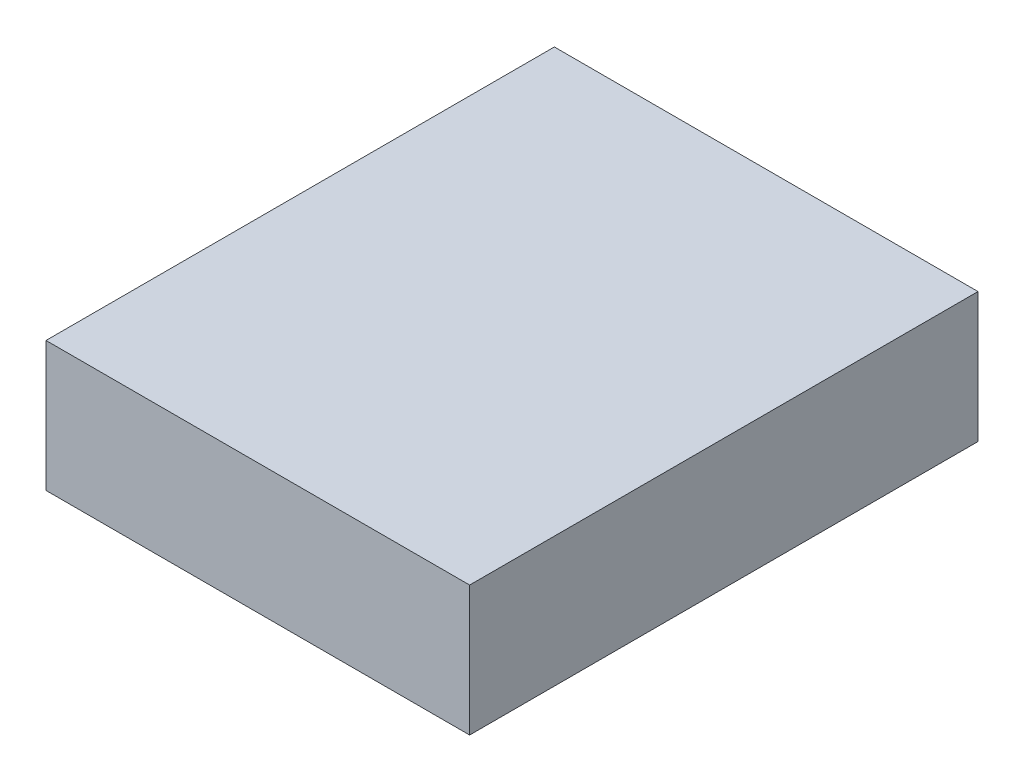
ISO-10303-21;
HEADER;
FILE_DESCRIPTION(('STEP AP214'),'2;1');
FILE_NAME('part.step','',(''),(''),'','','');
FILE_SCHEMA(('AUTOMOTIVE_DESIGN { 1 0 10303 214 1 1 1 1 }'));
ENDSEC;
DATA;
#1=APPLICATION_CONTEXT('core data for automotive mechanical design processes');
#2=APPLICATION_PROTOCOL_DEFINITION('international standard','automotive_design',2000,#1);
#3=PRODUCT_CONTEXT('',#1,'mechanical');
#4=PRODUCT('Part','Part','',(#3));
#5=PRODUCT_RELATED_PRODUCT_CATEGORY('part','',(#4));
#6=PRODUCT_DEFINITION_FORMATION('','',#4);
#7=PRODUCT_DEFINITION_CONTEXT('part definition',#1,'design');
#8=PRODUCT_DEFINITION('design','',#6,#7);
#9=PRODUCT_DEFINITION_SHAPE('','',#8);
#10=(LENGTH_UNIT() NAMED_UNIT(*) SI_UNIT(.MILLI.,.METRE.));
#11=(NAMED_UNIT(*) PLANE_ANGLE_UNIT() SI_UNIT($,.RADIAN.));
#12=(NAMED_UNIT(*) SI_UNIT($,.STERADIAN.) SOLID_ANGLE_UNIT());
#13=UNCERTAINTY_MEASURE_WITH_UNIT(LENGTH_MEASURE(1.E-05),#10,'distance_accuracy_value','');
#14=(GEOMETRIC_REPRESENTATION_CONTEXT(3) GLOBAL_UNCERTAINTY_ASSIGNED_CONTEXT((#13)) GLOBAL_UNIT_ASSIGNED_CONTEXT((#10,
#11,#12)) REPRESENTATION_CONTEXT('',''));
#15=CARTESIAN_POINT('',(0.,0.,0.));
#16=DIRECTION('',(0.,0.,1.));
#17=DIRECTION('',(1.,0.,0.));
#18=AXIS2_PLACEMENT_3D('',#15,#16,#17);
#19=CARTESIAN_POINT('',(-37.5626541764247,460.,-26.2684777517565));
#20=DIRECTION('',(1.,0.,0.));
#21=DIRECTION('',(0.,0.,-1.));
#22=AXIS2_PLACEMENT_3D('',#19,#20,#21);
#23=PLANE('',#22);
#24=DIRECTION('',(0.,0.,1.));
#25=VECTOR('',#24,1.);
#26=CARTESIAN_POINT('',(-37.5626541764247,0.,-26.2684777517565));
#27=LINE('',#26,#25);
#28=CARTESIAN_POINT('',(-37.5626541764247,0.,-26.2684777517565));
#29=VERTEX_POINT('',#28);
#30=CARTESIAN_POINT('',(-37.5626541764245,0.,1773.73152224824));
#31=VERTEX_POINT('',#30);
#32=EDGE_CURVE('E107',#29,#31,#27,.T.);
#33=ORIENTED_EDGE('',*,*,#32,.T.);
#34=DIRECTION('',(0.,-1.,0.));
#35=VECTOR('',#34,1.);
#36=CARTESIAN_POINT('',(-37.5626541764245,460.,1773.73152224824));
#37=LINE('',#36,#35);
#38=CARTESIAN_POINT('',(-37.5626541764245,460.,1773.73152224824));
#39=VERTEX_POINT('',#38);
#40=EDGE_CURVE('E11',#39,#31,#37,.T.);
#41=ORIENTED_EDGE('',*,*,#40,.F.);
#42=DIRECTION('',(0.,0.,1.));
#43=VECTOR('',#42,1.);
#44=CARTESIAN_POINT('',(-37.5626541764247,460.,-26.2684777517565));
#45=LINE('',#44,#43);
#46=CARTESIAN_POINT('',(-37.5626541764247,460.,-26.2684777517565));
#47=VERTEX_POINT('',#46);
#48=EDGE_CURVE('E91',#47,#39,#45,.T.);
#49=ORIENTED_EDGE('',*,*,#48,.F.);
#50=DIRECTION('',(0.,-1.,0.));
#51=VECTOR('',#50,1.);
#52=CARTESIAN_POINT('',(-37.5626541764247,460.,-26.2684777517565));
#53=LINE('',#52,#51);
#54=EDGE_CURVE('E103',#47,#29,#53,.T.);
#55=ORIENTED_EDGE('',*,*,#54,.T.);
#56=EDGE_LOOP('',(#33,#41,#49,#55));
#57=FACE_BOUND('',#56,.T.);
#58=ADVANCED_FACE('F39',(#57),#23,.F.);
#59=CARTESIAN_POINT('',(-37.5626541764245,460.,1773.73152224824));
#60=DIRECTION('',(0.,0.,-1.));
#61=DIRECTION('',(-1.,0.,0.));
#62=AXIS2_PLACEMENT_3D('',#59,#60,#61);
#63=PLANE('',#62);
#64=DIRECTION('',(1.,0.,0.));
#65=VECTOR('',#64,1.);
#66=CARTESIAN_POINT('',(-37.5626541764245,0.,1773.73152224824));
#67=LINE('',#66,#65);
#68=CARTESIAN_POINT('',(1462.43734582358,0.,1773.73152224824));
#69=VERTEX_POINT('',#68);
#70=EDGE_CURVE('E96',#31,#69,#67,.T.);
#71=ORIENTED_EDGE('',*,*,#70,.T.);
#72=DIRECTION('',(0.,-1.,0.));
#73=VECTOR('',#72,1.);
#74=CARTESIAN_POINT('',(1462.43734582358,460.,1773.73152224824));
#75=LINE('',#74,#73);
#76=CARTESIAN_POINT('',(1462.43734582358,460.,1773.73152224824));
#77=VERTEX_POINT('',#76);
#78=EDGE_CURVE('E48',#77,#69,#75,.T.);
#79=ORIENTED_EDGE('',*,*,#78,.F.);
#80=DIRECTION('',(1.,0.,0.));
#81=VECTOR('',#80,1.);
#82=CARTESIAN_POINT('',(-37.5626541764245,460.,1773.73152224824));
#83=LINE('',#82,#81);
#84=EDGE_CURVE('E86',#39,#77,#83,.T.);
#85=ORIENTED_EDGE('',*,*,#84,.F.);
#86=ORIENTED_EDGE('',*,*,#40,.T.);
#87=EDGE_LOOP('',(#71,#79,#85,#86));
#88=FACE_BOUND('',#87,.T.);
#89=ADVANCED_FACE('F95',(#88),#63,.F.);
#90=CARTESIAN_POINT('',(1462.43734582358,460.,-26.2684777517565));
#91=DIRECTION('',(-1.,0.,0.));
#92=DIRECTION('',(0.,0.,1.));
#93=AXIS2_PLACEMENT_3D('',#90,#91,#92);
#94=PLANE('',#93);
#95=DIRECTION('',(0.,0.,-1.));
#96=VECTOR('',#95,1.);
#97=CARTESIAN_POINT('',(1462.43734582358,0.,-26.2684777517565));
#98=LINE('',#97,#96);
#99=CARTESIAN_POINT('',(1462.43734582358,0.,-26.2684777517565));
#100=VERTEX_POINT('',#99);
#101=EDGE_CURVE('E73',#69,#100,#98,.T.);
#102=ORIENTED_EDGE('',*,*,#101,.T.);
#103=DIRECTION('',(0.,-1.,0.));
#104=VECTOR('',#103,1.);
#105=CARTESIAN_POINT('',(1462.43734582358,460.,-26.2684777517565));
#106=LINE('',#105,#104);
#107=CARTESIAN_POINT('',(1462.43734582358,460.,-26.2684777517565));
#108=VERTEX_POINT('',#107);
#109=EDGE_CURVE('E98',#108,#100,#106,.T.);
#110=ORIENTED_EDGE('',*,*,#109,.F.);
#111=DIRECTION('',(0.,0.,-1.));
#112=VECTOR('',#111,1.);
#113=CARTESIAN_POINT('',(1462.43734582358,460.,-26.2684777517565));
#114=LINE('',#113,#112);
#115=EDGE_CURVE('E89',#77,#108,#114,.T.);
#116=ORIENTED_EDGE('',*,*,#115,.F.);
#117=ORIENTED_EDGE('',*,*,#78,.T.);
#118=EDGE_LOOP('',(#102,#110,#116,#117));
#119=FACE_BOUND('',#118,.T.);
#120=ADVANCED_FACE('F99',(#119),#94,.F.);
#121=CARTESIAN_POINT('',(-37.5626541764247,460.,-26.2684777517565));
#122=DIRECTION('',(0.,0.,1.));
#123=DIRECTION('',(1.,0.,0.));
#124=AXIS2_PLACEMENT_3D('',#121,#122,#123);
#125=PLANE('',#124);
#126=DIRECTION('',(-1.,0.,0.));
#127=VECTOR('',#126,1.);
#128=CARTESIAN_POINT('',(-37.5626541764247,0.,-26.2684777517565));
#129=LINE('',#128,#127);
#130=EDGE_CURVE('E79',#100,#29,#129,.T.);
#131=ORIENTED_EDGE('',*,*,#130,.T.);
#132=ORIENTED_EDGE('',*,*,#54,.F.);
#133=DIRECTION('',(-1.,0.,0.));
#134=VECTOR('',#133,1.);
#135=CARTESIAN_POINT('',(-37.5626541764247,460.,-26.2684777517565));
#136=LINE('',#135,#134);
#137=EDGE_CURVE('E56',#108,#47,#136,.T.);
#138=ORIENTED_EDGE('',*,*,#137,.F.);
#139=ORIENTED_EDGE('',*,*,#109,.T.);
#140=EDGE_LOOP('',(#131,#132,#138,#139));
#141=FACE_BOUND('',#140,.T.);
#142=ADVANCED_FACE('F120',(#141),#125,.F.);
#143=CARTESIAN_POINT('',(0.,460.,0.));
#144=DIRECTION('',(0.,1.,0.));
#145=DIRECTION('',(0.,0.,1.));
#146=AXIS2_PLACEMENT_3D('',#143,#144,#145);
#147=PLANE('',#146);
#148=ORIENTED_EDGE('',*,*,#48,.T.);
#149=ORIENTED_EDGE('',*,*,#84,.T.);
#150=ORIENTED_EDGE('',*,*,#115,.T.);
#151=ORIENTED_EDGE('',*,*,#137,.T.);
#152=EDGE_LOOP('',(#148,#149,#150,#151));
#153=FACE_BOUND('',#152,.T.);
#154=ADVANCED_FACE('F87',(#153),#147,.T.);
#155=CARTESIAN_POINT('',(0.,0.,0.));
#156=DIRECTION('',(0.,1.,0.));
#157=DIRECTION('',(0.,0.,1.));
#158=AXIS2_PLACEMENT_3D('',#155,#156,#157);
#159=PLANE('',#158);
#160=ORIENTED_EDGE('',*,*,#32,.F.);
#161=ORIENTED_EDGE('',*,*,#130,.F.);
#162=ORIENTED_EDGE('',*,*,#101,.F.);
#163=ORIENTED_EDGE('',*,*,#70,.F.);
#164=EDGE_LOOP('',(#160,#161,#162,#163));
#165=FACE_BOUND('',#164,.T.);
#166=ADVANCED_FACE('F123',(#165),#159,.F.);
#167=CLOSED_SHELL('',(#58,#89,#120,#142,#154,#166));
#168=MANIFOLD_SOLID_BREP('B2',#167);
#169=ADVANCED_BREP_SHAPE_REPRESENTATION('',(#18,#168),#14);
#170=SHAPE_DEFINITION_REPRESENTATION(#9,#169);
ENDSEC;
END-ISO-10303-21;
